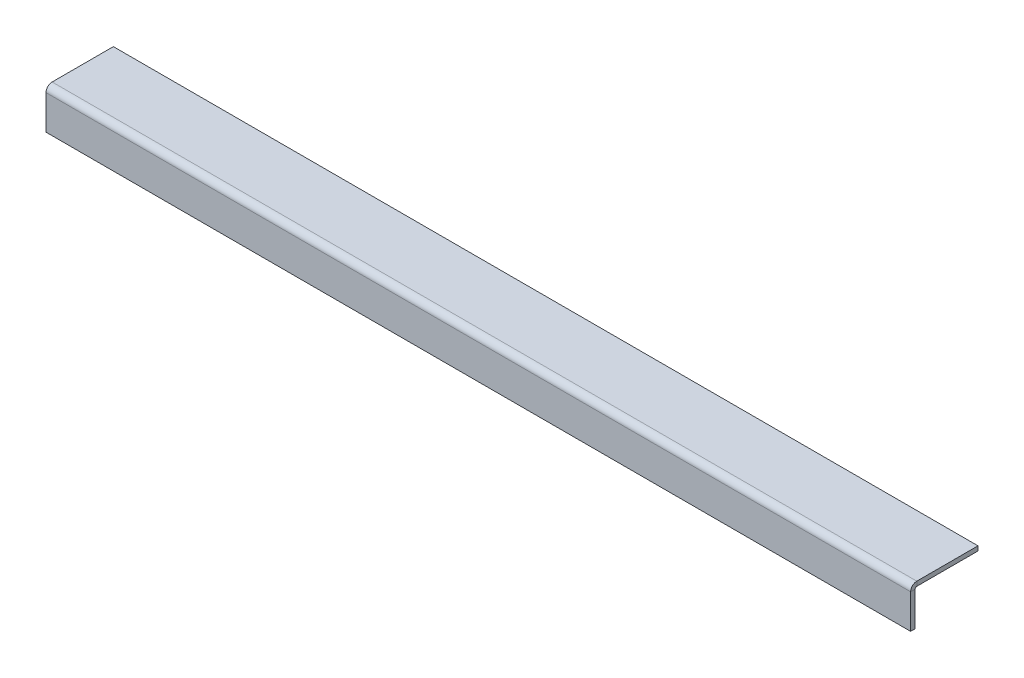
ISO-10303-21;
HEADER;
FILE_DESCRIPTION(('STEP AP214'),'2;1');
FILE_NAME('part.step','',(''),(''),'','','');
FILE_SCHEMA(('AUTOMOTIVE_DESIGN { 1 0 10303 214 1 1 1 1 }'));
ENDSEC;
DATA;
#1=APPLICATION_CONTEXT('core data for automotive mechanical design processes');
#2=APPLICATION_PROTOCOL_DEFINITION('international standard','automotive_design',2000,#1);
#3=PRODUCT_CONTEXT('',#1,'mechanical');
#4=PRODUCT('Part','Part','',(#3));
#5=PRODUCT_RELATED_PRODUCT_CATEGORY('part','',(#4));
#6=PRODUCT_DEFINITION_FORMATION('','',#4);
#7=PRODUCT_DEFINITION_CONTEXT('part definition',#1,'design');
#8=PRODUCT_DEFINITION('design','',#6,#7);
#9=PRODUCT_DEFINITION_SHAPE('','',#8);
#10=(LENGTH_UNIT() NAMED_UNIT(*) SI_UNIT(.MILLI.,.METRE.));
#11=(NAMED_UNIT(*) PLANE_ANGLE_UNIT() SI_UNIT($,.RADIAN.));
#12=(NAMED_UNIT(*) SI_UNIT($,.STERADIAN.) SOLID_ANGLE_UNIT());
#13=UNCERTAINTY_MEASURE_WITH_UNIT(LENGTH_MEASURE(1.E-05),#10,'distance_accuracy_value','');
#14=(GEOMETRIC_REPRESENTATION_CONTEXT(3) GLOBAL_UNCERTAINTY_ASSIGNED_CONTEXT((#13)) GLOBAL_UNIT_ASSIGNED_CONTEXT((#10,
#11,#12)) REPRESENTATION_CONTEXT('',''));
#15=CARTESIAN_POINT('',(0.,0.,0.));
#16=DIRECTION('',(0.,0.,1.));
#17=DIRECTION('',(1.,0.,0.));
#18=AXIS2_PLACEMENT_3D('',#15,#16,#17);
#19=CARTESIAN_POINT('',(-192.5,-2.,-30.));
#20=DIRECTION('',(-1.,0.,0.));
#21=DIRECTION('',(0.,0.,1.));
#22=AXIS2_PLACEMENT_3D('',#19,#20,#21);
#23=PLANE('',#22);
#24=DIRECTION('',(0.,0.,1.));
#25=VECTOR('',#24,1.);
#26=CARTESIAN_POINT('',(-192.5,-2.,-30.));
#27=LINE('',#26,#25);
#28=CARTESIAN_POINT('',(-192.5,-2.,-30.));
#29=VERTEX_POINT('',#28);
#30=CARTESIAN_POINT('',(-192.5,-1.99999999999999,-2.73659999999995));
#31=VERTEX_POINT('',#30);
#32=EDGE_CURVE('E110',#29,#31,#27,.T.);
#33=ORIENTED_EDGE('',*,*,#32,.T.);
#34=DIRECTION('',(0.,1.,0.));
#35=VECTOR('',#34,1.);
#36=CARTESIAN_POINT('',(-192.5,-1.99999999999999,-2.73659999999995));
#37=LINE('',#36,#35);
#38=CARTESIAN_POINT('',(-192.5,0.,-2.73659999999995));
#39=VERTEX_POINT('',#38);
#40=EDGE_CURVE('E101',#31,#39,#37,.T.);
#41=ORIENTED_EDGE('',*,*,#40,.T.);
#42=DIRECTION('',(0.,0.,1.));
#43=VECTOR('',#42,1.);
#44=CARTESIAN_POINT('',(-192.5,0.,-30.));
#45=LINE('',#44,#43);
#46=CARTESIAN_POINT('',(-192.5,0.,-30.));
#47=VERTEX_POINT('',#46);
#48=EDGE_CURVE('E99',#47,#39,#45,.T.);
#49=ORIENTED_EDGE('',*,*,#48,.F.);
#50=DIRECTION('',(0.,1.,0.));
#51=VECTOR('',#50,1.);
#52=CARTESIAN_POINT('',(-192.5,-2.,-30.));
#53=LINE('',#52,#51);
#54=EDGE_CURVE('E13',#29,#47,#53,.T.);
#55=ORIENTED_EDGE('',*,*,#54,.F.);
#56=EDGE_LOOP('',(#33,#41,#49,#55));
#57=FACE_BOUND('',#56,.T.);
#58=ADVANCED_FACE('F57',(#57),#23,.T.);
#59=CARTESIAN_POINT('',(0.,-2.,0.));
#60=DIRECTION('',(0.,1.,0.));
#61=DIRECTION('',(0.,0.,1.));
#62=AXIS2_PLACEMENT_3D('',#59,#60,#61);
#63=PLANE('',#62);
#64=DIRECTION('',(-1.,0.,0.));
#65=VECTOR('',#64,1.);
#66=CARTESIAN_POINT('',(-192.5,-1.99999999999999,-2.73659999999995));
#67=LINE('',#66,#65);
#68=CARTESIAN_POINT('',(192.5,-1.99999999999999,-2.73659999999995));
#69=VERTEX_POINT('',#68);
#70=EDGE_CURVE('E123',#31,#69,#67,.F.);
#71=ORIENTED_EDGE('',*,*,#70,.F.);
#72=ORIENTED_EDGE('',*,*,#32,.F.);
#73=DIRECTION('',(-1.,0.,0.));
#74=VECTOR('',#73,1.);
#75=CARTESIAN_POINT('',(-192.5,-2.,-30.));
#76=LINE('',#75,#74);
#77=CARTESIAN_POINT('',(192.5,-2.,-30.));
#78=VERTEX_POINT('',#77);
#79=EDGE_CURVE('E96',#78,#29,#76,.T.);
#80=ORIENTED_EDGE('',*,*,#79,.F.);
#81=DIRECTION('',(0.,0.,-1.));
#82=VECTOR('',#81,1.);
#83=CARTESIAN_POINT('',(192.5,-2.,-30.));
#84=LINE('',#83,#82);
#85=EDGE_CURVE('E112',#69,#78,#84,.T.);
#86=ORIENTED_EDGE('',*,*,#85,.F.);
#87=EDGE_LOOP('',(#71,#72,#80,#86));
#88=FACE_BOUND('',#87,.T.);
#89=ADVANCED_FACE('F227',(#88),#63,.F.);
#90=CARTESIAN_POINT('',(0.,0.,0.));
#91=DIRECTION('',(0.,1.,0.));
#92=DIRECTION('',(0.,0.,1.));
#93=AXIS2_PLACEMENT_3D('',#90,#91,#92);
#94=PLANE('',#93);
#95=ORIENTED_EDGE('',*,*,#48,.T.);
#96=DIRECTION('',(-1.,0.,0.));
#97=VECTOR('',#96,1.);
#98=CARTESIAN_POINT('',(-192.5,0.,-2.73659999999995));
#99=LINE('',#98,#97);
#100=CARTESIAN_POINT('',(192.5,0.,-2.73659999999995));
#101=VERTEX_POINT('',#100);
#102=EDGE_CURVE('E133',#39,#101,#99,.F.);
#103=ORIENTED_EDGE('',*,*,#102,.T.);
#104=DIRECTION('',(0.,0.,-1.));
#105=VECTOR('',#104,1.);
#106=CARTESIAN_POINT('',(192.5,0.,-30.));
#107=LINE('',#106,#105);
#108=CARTESIAN_POINT('',(192.5,0.,-30.));
#109=VERTEX_POINT('',#108);
#110=EDGE_CURVE('E104',#101,#109,#107,.T.);
#111=ORIENTED_EDGE('',*,*,#110,.T.);
#112=DIRECTION('',(-1.,0.,0.));
#113=VECTOR('',#112,1.);
#114=CARTESIAN_POINT('',(-192.5,0.,-30.));
#115=LINE('',#114,#113);
#116=EDGE_CURVE('E94',#109,#47,#115,.T.);
#117=ORIENTED_EDGE('',*,*,#116,.T.);
#118=EDGE_LOOP('',(#95,#103,#111,#117));
#119=FACE_BOUND('',#118,.T.);
#120=ADVANCED_FACE('F107',(#119),#94,.T.);
#121=CARTESIAN_POINT('',(-192.5,-2.,-30.));
#122=DIRECTION('',(0.,0.,-1.));
#123=DIRECTION('',(-1.,0.,0.));
#124=AXIS2_PLACEMENT_3D('',#121,#122,#123);
#125=PLANE('',#124);
#126=ORIENTED_EDGE('',*,*,#116,.F.);
#127=DIRECTION('',(0.,1.,0.));
#128=VECTOR('',#127,1.);
#129=CARTESIAN_POINT('',(192.5,-2.,-30.));
#130=LINE('',#129,#128);
#131=EDGE_CURVE('E60',#78,#109,#130,.T.);
#132=ORIENTED_EDGE('',*,*,#131,.F.);
#133=ORIENTED_EDGE('',*,*,#79,.T.);
#134=ORIENTED_EDGE('',*,*,#54,.T.);
#135=EDGE_LOOP('',(#126,#132,#133,#134));
#136=FACE_BOUND('',#135,.T.);
#137=ADVANCED_FACE('F91',(#136),#125,.T.);
#138=CARTESIAN_POINT('',(192.5,-2.,-30.));
#139=DIRECTION('',(1.,0.,0.));
#140=DIRECTION('',(0.,0.,-1.));
#141=AXIS2_PLACEMENT_3D('',#138,#139,#140);
#142=PLANE('',#141);
#143=DIRECTION('',(0.,1.,0.));
#144=VECTOR('',#143,1.);
#145=CARTESIAN_POINT('',(192.5,-1.99999999999999,-2.73659999999995));
#146=LINE('',#145,#144);
#147=EDGE_CURVE('E105',#69,#101,#146,.T.);
#148=ORIENTED_EDGE('',*,*,#147,.F.);
#149=ORIENTED_EDGE('',*,*,#85,.T.);
#150=ORIENTED_EDGE('',*,*,#131,.T.);
#151=ORIENTED_EDGE('',*,*,#110,.F.);
#152=EDGE_LOOP('',(#148,#149,#150,#151));
#153=FACE_BOUND('',#152,.T.);
#154=ADVANCED_FACE('F225',(#153),#142,.T.);
#155=CARTESIAN_POINT('',(192.5,-2.73659999999999,-2.73659999999995));
#156=DIRECTION('',(1.,0.,0.));
#157=DIRECTION('',(0.,0.,-1.));
#158=AXIS2_PLACEMENT_3D('',#155,#156,#157);
#159=PLANE('',#158);
#160=DIRECTION('',(0.,0.,-1.));
#161=VECTOR('',#160,1.);
#162=CARTESIAN_POINT('',(192.5,-2.7366,0.));
#163=LINE('',#162,#161);
#164=CARTESIAN_POINT('',(192.5,-2.73659999999999,-1.99999999999995));
#165=VERTEX_POINT('',#164);
#166=CARTESIAN_POINT('',(192.5,-2.73659999999998,0.));
#167=VERTEX_POINT('',#166);
#168=EDGE_CURVE('E136',#165,#167,#163,.F.);
#169=ORIENTED_EDGE('',*,*,#168,.F.);
#170=CARTESIAN_POINT('',(192.5,-2.73659999999999,-2.73659999999995));
#171=DIRECTION('',(-1.,0.,0.));
#172=DIRECTION('',(0.,0.,1.));
#173=AXIS2_PLACEMENT_3D('',#170,#171,#172);
#174=CIRCLE('',#173,0.7366);
#175=EDGE_CURVE('E127',#69,#165,#174,.F.);
#176=ORIENTED_EDGE('',*,*,#175,.F.);
#177=ORIENTED_EDGE('',*,*,#147,.T.);
#178=CARTESIAN_POINT('',(192.5,-2.73659999999999,-2.73659999999995));
#179=DIRECTION('',(-1.,0.,0.));
#180=DIRECTION('',(0.,0.,1.));
#181=AXIS2_PLACEMENT_3D('',#178,#179,#180);
#182=CIRCLE('',#181,2.7366);
#183=EDGE_CURVE('E71',#101,#167,#182,.F.);
#184=ORIENTED_EDGE('',*,*,#183,.T.);
#185=EDGE_LOOP('',(#169,#176,#177,#184));
#186=FACE_BOUND('',#185,.T.);
#187=ADVANCED_FACE('F221',(#186),#159,.T.);
#188=CARTESIAN_POINT('',(-192.5,-2.73659999999999,-2.73659999999995));
#189=DIRECTION('',(1.,0.,0.));
#190=DIRECTION('',(0.,0.,-1.));
#191=AXIS2_PLACEMENT_3D('',#188,#189,#190);
#192=PLANE('',#191);
#193=CARTESIAN_POINT('',(-192.5,-2.73659999999999,-2.73659999999995));
#194=DIRECTION('',(-1.,0.,0.));
#195=DIRECTION('',(0.,0.,1.));
#196=AXIS2_PLACEMENT_3D('',#193,#194,#195);
#197=CIRCLE('',#196,0.7366);
#198=CARTESIAN_POINT('',(-192.5,-2.73659999999999,-1.99999999999995));
#199=VERTEX_POINT('',#198);
#200=EDGE_CURVE('E120',#199,#31,#197,.T.);
#201=ORIENTED_EDGE('',*,*,#200,.F.);
#202=DIRECTION('',(0.,0.,-1.));
#203=VECTOR('',#202,1.);
#204=CARTESIAN_POINT('',(-192.5,-2.73659999999999,-1.99999999999995));
#205=LINE('',#204,#203);
#206=CARTESIAN_POINT('',(-192.5,-2.73659999999999,0.));
#207=VERTEX_POINT('',#206);
#208=EDGE_CURVE('E142',#199,#207,#205,.F.);
#209=ORIENTED_EDGE('',*,*,#208,.T.);
#210=CARTESIAN_POINT('',(-192.5,-2.73659999999999,-2.73659999999995));
#211=DIRECTION('',(-1.,0.,0.));
#212=DIRECTION('',(0.,0.,1.));
#213=AXIS2_PLACEMENT_3D('',#210,#211,#212);
#214=CIRCLE('',#213,2.7366);
#215=EDGE_CURVE('E130',#207,#39,#214,.T.);
#216=ORIENTED_EDGE('',*,*,#215,.T.);
#217=ORIENTED_EDGE('',*,*,#40,.F.);
#218=EDGE_LOOP('',(#201,#209,#216,#217));
#219=FACE_BOUND('',#218,.T.);
#220=ADVANCED_FACE('F213',(#219),#192,.F.);
#221=CARTESIAN_POINT('',(-192.5,-2.73659999999999,-2.73659999999995));
#222=DIRECTION('',(-1.,0.,0.));
#223=DIRECTION('',(0.,0.,1.));
#224=AXIS2_PLACEMENT_3D('',#221,#222,#223);
#225=CYLINDRICAL_SURFACE('',#224,2.7366);
#226=ORIENTED_EDGE('',*,*,#102,.F.);
#227=ORIENTED_EDGE('',*,*,#215,.F.);
#228=DIRECTION('',(-1.,0.,0.));
#229=VECTOR('',#228,1.);
#230=CARTESIAN_POINT('',(192.5,-2.7366,0.));
#231=LINE('',#230,#229);
#232=EDGE_CURVE('E145',#207,#167,#231,.F.);
#233=ORIENTED_EDGE('',*,*,#232,.T.);
#234=ORIENTED_EDGE('',*,*,#183,.F.);
#235=EDGE_LOOP('',(#226,#227,#233,#234));
#236=FACE_BOUND('',#235,.T.);
#237=ADVANCED_FACE('F219',(#236),#225,.T.);
#238=CARTESIAN_POINT('',(-192.5,-2.73659999999999,-2.73659999999995));
#239=DIRECTION('',(-1.,0.,0.));
#240=DIRECTION('',(0.,0.,1.));
#241=AXIS2_PLACEMENT_3D('',#238,#239,#240);
#242=CYLINDRICAL_SURFACE('',#241,0.7366);
#243=ORIENTED_EDGE('',*,*,#70,.T.);
#244=ORIENTED_EDGE('',*,*,#175,.T.);
#245=DIRECTION('',(-1.,0.,0.));
#246=VECTOR('',#245,1.);
#247=CARTESIAN_POINT('',(192.5,-2.7366,-1.99999999999995));
#248=LINE('',#247,#246);
#249=EDGE_CURVE('E139',#165,#199,#248,.T.);
#250=ORIENTED_EDGE('',*,*,#249,.T.);
#251=ORIENTED_EDGE('',*,*,#200,.T.);
#252=EDGE_LOOP('',(#243,#244,#250,#251));
#253=FACE_BOUND('',#252,.T.);
#254=ADVANCED_FACE('F207',(#253),#242,.F.);
#255=CARTESIAN_POINT('',(-192.5,-18.,1.01915004213637E-13));
#256=DIRECTION('',(1.,0.,0.));
#257=DIRECTION('',(0.,0.,-1.));
#258=AXIS2_PLACEMENT_3D('',#255,#256,#257);
#259=PLANE('',#258);
#260=ORIENTED_EDGE('',*,*,#208,.F.);
#261=DIRECTION('',(0.,1.,0.));
#262=VECTOR('',#261,1.);
#263=CARTESIAN_POINT('',(-192.5,-18.,-1.9999999999999));
#264=LINE('',#263,#262);
#265=CARTESIAN_POINT('',(-192.5,-18.,-1.9999999999999));
#266=VERTEX_POINT('',#265);
#267=EDGE_CURVE('E147',#199,#266,#264,.F.);
#268=ORIENTED_EDGE('',*,*,#267,.T.);
#269=DIRECTION('',(0.,0.,-1.));
#270=VECTOR('',#269,1.);
#271=CARTESIAN_POINT('',(-192.5,-18.,1.01915004213637E-13));
#272=LINE('',#271,#270);
#273=CARTESIAN_POINT('',(-192.5,-18.,1.02311623177649E-13));
#274=VERTEX_POINT('',#273);
#275=EDGE_CURVE('E124',#274,#266,#272,.T.);
#276=ORIENTED_EDGE('',*,*,#275,.F.);
#277=DIRECTION('',(0.,-1.,0.));
#278=VECTOR('',#277,1.);
#279=CARTESIAN_POINT('',(-192.5,0.,0.));
#280=LINE('',#279,#278);
#281=EDGE_CURVE('E156',#207,#274,#280,.T.);
#282=ORIENTED_EDGE('',*,*,#281,.F.);
#283=EDGE_LOOP('',(#260,#268,#276,#282));
#284=FACE_BOUND('',#283,.T.);
#285=ADVANCED_FACE('F183',(#284),#259,.F.);
#286=CARTESIAN_POINT('',(192.5,-1.99999999999999,0.));
#287=DIRECTION('',(-1.,0.,0.));
#288=DIRECTION('',(0.,0.,1.));
#289=AXIS2_PLACEMENT_3D('',#286,#287,#288);
#290=PLANE('',#289);
#291=ORIENTED_EDGE('',*,*,#168,.T.);
#292=DIRECTION('',(0.,1.,0.));
#293=VECTOR('',#292,1.);
#294=CARTESIAN_POINT('',(192.5,0.,0.));
#295=LINE('',#294,#293);
#296=CARTESIAN_POINT('',(192.5,-18.,1.02311623177649E-13));
#297=VERTEX_POINT('',#296);
#298=EDGE_CURVE('E162',#297,#167,#295,.T.);
#299=ORIENTED_EDGE('',*,*,#298,.F.);
#300=DIRECTION('',(0.,0.,-1.));
#301=VECTOR('',#300,1.);
#302=CARTESIAN_POINT('',(192.5,-18.,1.0226755440387E-13));
#303=LINE('',#302,#301);
#304=CARTESIAN_POINT('',(192.5,-18.,-1.9999999999999));
#305=VERTEX_POINT('',#304);
#306=EDGE_CURVE('E165',#297,#305,#303,.T.);
#307=ORIENTED_EDGE('',*,*,#306,.T.);
#308=DIRECTION('',(0.,-1.,0.));
#309=VECTOR('',#308,1.);
#310=CARTESIAN_POINT('',(192.5,-2.,-1.99999999999995));
#311=LINE('',#310,#309);
#312=EDGE_CURVE('E153',#305,#165,#311,.F.);
#313=ORIENTED_EDGE('',*,*,#312,.T.);
#314=EDGE_LOOP('',(#291,#299,#307,#313));
#315=FACE_BOUND('',#314,.T.);
#316=ADVANCED_FACE('F216',(#315),#290,.F.);
#317=CARTESIAN_POINT('',(0.,0.,0.));
#318=DIRECTION('',(0.,0.,-1.));
#319=DIRECTION('',(0.,1.,0.));
#320=AXIS2_PLACEMENT_3D('',#317,#318,#319);
#321=PLANE('',#320);
#322=ORIENTED_EDGE('',*,*,#232,.F.);
#323=ORIENTED_EDGE('',*,*,#281,.T.);
#324=DIRECTION('',(1.,0.,0.));
#325=VECTOR('',#324,1.);
#326=CARTESIAN_POINT('',(0.,-18.,1.02311623177649E-13));
#327=LINE('',#326,#325);
#328=EDGE_CURVE('E159',#274,#297,#327,.T.);
#329=ORIENTED_EDGE('',*,*,#328,.T.);
#330=ORIENTED_EDGE('',*,*,#298,.T.);
#331=EDGE_LOOP('',(#322,#323,#329,#330));
#332=FACE_BOUND('',#331,.T.);
#333=ADVANCED_FACE('F218',(#332),#321,.F.);
#334=CARTESIAN_POINT('',(0.,0.,-1.99999999999996));
#335=DIRECTION('',(0.,0.,-1.));
#336=DIRECTION('',(0.,1.,0.));
#337=AXIS2_PLACEMENT_3D('',#334,#335,#336);
#338=PLANE('',#337);
#339=ORIENTED_EDGE('',*,*,#267,.F.);
#340=ORIENTED_EDGE('',*,*,#249,.F.);
#341=ORIENTED_EDGE('',*,*,#312,.F.);
#342=DIRECTION('',(-1.,0.,0.));
#343=VECTOR('',#342,1.);
#344=CARTESIAN_POINT('',(192.5,-18.,-1.9999999999999));
#345=LINE('',#344,#343);
#346=EDGE_CURVE('E150',#266,#305,#345,.F.);
#347=ORIENTED_EDGE('',*,*,#346,.F.);
#348=EDGE_LOOP('',(#339,#340,#341,#347));
#349=FACE_BOUND('',#348,.T.);
#350=ADVANCED_FACE('F214',(#349),#338,.T.);
#351=CARTESIAN_POINT('',(192.5,-18.,1.01915004213637E-13));
#352=DIRECTION('',(0.,1.,0.));
#353=DIRECTION('',(0.,0.,1.));
#354=AXIS2_PLACEMENT_3D('',#351,#352,#353);
#355=PLANE('',#354);
#356=ORIENTED_EDGE('',*,*,#346,.T.);
#357=ORIENTED_EDGE('',*,*,#306,.F.);
#358=ORIENTED_EDGE('',*,*,#328,.F.);
#359=ORIENTED_EDGE('',*,*,#275,.T.);
#360=EDGE_LOOP('',(#356,#357,#358,#359));
#361=FACE_BOUND('',#360,.T.);
#362=ADVANCED_FACE('F173',(#361),#355,.F.);
#363=CLOSED_SHELL('',(#58,#89,#120,#137,#154,#187,#220,#237,#254,#285,#316,#333,#350,#362));
#364=MANIFOLD_SOLID_BREP('B2',#363);
#365=ADVANCED_BREP_SHAPE_REPRESENTATION('',(#18,#364),#14);
#366=SHAPE_DEFINITION_REPRESENTATION(#9,#365);
ENDSEC;
END-ISO-10303-21;
